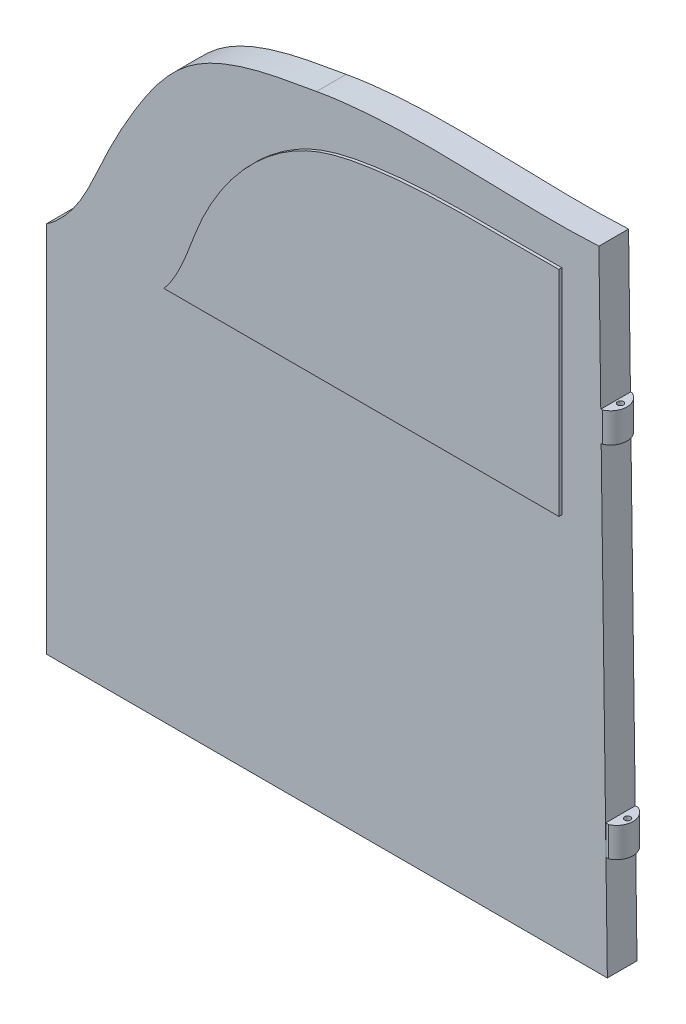
ISO-10303-21;
HEADER;
FILE_DESCRIPTION(('STEP AP214'),'2;1');
FILE_NAME('part.step','',(''),(''),'','','');
FILE_SCHEMA(('AUTOMOTIVE_DESIGN { 1 0 10303 214 1 1 1 1 }'));
ENDSEC;
DATA;
#1=APPLICATION_CONTEXT('core data for automotive mechanical design processes');
#2=APPLICATION_PROTOCOL_DEFINITION('international standard','automotive_design',2000,#1);
#3=PRODUCT_CONTEXT('',#1,'mechanical');
#4=PRODUCT('Part','Part','',(#3));
#5=PRODUCT_RELATED_PRODUCT_CATEGORY('part','',(#4));
#6=PRODUCT_DEFINITION_FORMATION('','',#4);
#7=PRODUCT_DEFINITION_CONTEXT('part definition',#1,'design');
#8=PRODUCT_DEFINITION('design','',#6,#7);
#9=PRODUCT_DEFINITION_SHAPE('','',#8);
#10=(LENGTH_UNIT() NAMED_UNIT(*) SI_UNIT(.MILLI.,.METRE.));
#11=(NAMED_UNIT(*) PLANE_ANGLE_UNIT() SI_UNIT($,.RADIAN.));
#12=(NAMED_UNIT(*) SI_UNIT($,.STERADIAN.) SOLID_ANGLE_UNIT());
#13=UNCERTAINTY_MEASURE_WITH_UNIT(LENGTH_MEASURE(1.E-05),#10,'distance_accuracy_value','');
#14=(GEOMETRIC_REPRESENTATION_CONTEXT(3) GLOBAL_UNCERTAINTY_ASSIGNED_CONTEXT((#13)) GLOBAL_UNIT_ASSIGNED_CONTEXT((#10,
#11,#12)) REPRESENTATION_CONTEXT('',''));
#15=CARTESIAN_POINT('',(0.,0.,0.));
#16=DIRECTION('',(0.,0.,1.));
#17=DIRECTION('',(1.,0.,0.));
#18=AXIS2_PLACEMENT_3D('',#15,#16,#17);
#19=CARTESIAN_POINT('',(138.609555806472,212.457996663782,0.));
#20=DIRECTION('',(0.,0.,1.));
#21=DIRECTION('',(1.,0.,0.));
#22=AXIS2_PLACEMENT_3D('',#19,#20,#21);
#23=PLANE('',#22);
#24=DIRECTION('',(0.,1.,0.));
#25=VECTOR('',#24,1.);
#26=CARTESIAN_POINT('',(173.803726190315,212.457996663782,0.));
#27=LINE('',#26,#25);
#28=CARTESIAN_POINT('',(173.803726190315,127.565231362125,0.));
#29=VERTEX_POINT('',#28);
#30=CARTESIAN_POINT('',(173.803726190315,199.679337800593,0.));
#31=VERTEX_POINT('',#30);
#32=EDGE_CURVE('E489',#29,#31,#27,.T.);
#33=ORIENTED_EDGE('',*,*,#32,.T.);
#34=CARTESIAN_POINT('',(173.803726190315,199.679337800593,0.));
#35=CARTESIAN_POINT('',(152.264868916358,199.362802741396,0.));
#36=CARTESIAN_POINT('',(124.317503439642,201.038762955487,0.));
#37=CARTESIAN_POINT('',(78.4575076434082,191.212262770852,0.));
#38=CARTESIAN_POINT('',(53.3691343930654,161.704453989201,0.));
#39=CARTESIAN_POINT('',(46.7712903409994,134.93330682704,0.));
#40=CARTESIAN_POINT('',(40.691917072669,127.565231362125,0.));
#41=B_SPLINE_CURVE_WITH_KNOTS('',3,(#34,#35,#36,#37,#38,#39,#40),.UNSPECIFIED.,.F.,.F.,(4,1,1,1,
4),(0.,0.388400772627432,0.499498315224305,0.834382390259932,1.),.UNSPECIFIED.);
#42=CARTESIAN_POINT('',(40.691917072669,127.565231362125,0.));
#43=VERTEX_POINT('',#42);
#44=EDGE_CURVE('E63',#31,#43,#41,.T.);
#45=ORIENTED_EDGE('',*,*,#44,.T.);
#46=DIRECTION('',(1.,0.,0.));
#47=VECTOR('',#46,1.);
#48=CARTESIAN_POINT('',(138.609555806472,127.565231362125,0.));
#49=LINE('',#48,#47);
#50=EDGE_CURVE('E485',#43,#29,#49,.T.);
#51=ORIENTED_EDGE('',*,*,#50,.T.);
#52=EDGE_LOOP('',(#33,#45,#51));
#53=FACE_BOUND('',#52,.T.);
#54=DIRECTION('',(-0.0134158665656854,0.999910003212435,0.));
#55=VECTOR('',#54,1.);
#56=CARTESIAN_POINT('',(186.280110434595,212.216863760996,0.));
#57=LINE('',#56,#55);
#58=CARTESIAN_POINT('',(186.972854643501,160.585322797063,0.));
#59=VERTEX_POINT('',#58);
#60=CARTESIAN_POINT('',(186.280110434595,212.216863760996,0.));
#61=VERTEX_POINT('',#60);
#62=EDGE_CURVE('E461',#59,#61,#57,.T.);
#63=ORIENTED_EDGE('',*,*,#62,.F.);
#64=DIRECTION('',(0.,-1.,0.));
#65=VECTOR('',#64,1.);
#66=CARTESIAN_POINT('',(186.972854643501,165.,0.));
#67=LINE('',#66,#65);
#68=CARTESIAN_POINT('',(186.972854643501,165.,0.));
#69=VERTEX_POINT('',#68);
#70=EDGE_CURVE('E276',#69,#59,#67,.T.);
#71=ORIENTED_EDGE('',*,*,#70,.F.);
#72=DIRECTION('',(1.,0.,0.));
#73=VECTOR('',#72,1.);
#74=CARTESIAN_POINT('',(186.972854643501,165.,0.));
#75=LINE('',#74,#73);
#76=CARTESIAN_POINT('',(187.472854643501,165.,0.));
#77=VERTEX_POINT('',#76);
#78=EDGE_CURVE('E272',#69,#77,#75,.T.);
#79=ORIENTED_EDGE('',*,*,#78,.T.);
#80=DIRECTION('',(0.,-1.,0.));
#81=VECTOR('',#80,1.);
#82=CARTESIAN_POINT('',(187.472854643501,165.,0.));
#83=LINE('',#82,#81);
#84=CARTESIAN_POINT('',(187.472854643501,155.,0.));
#85=VERTEX_POINT('',#84);
#86=EDGE_CURVE('E280',#77,#85,#83,.T.);
#87=ORIENTED_EDGE('',*,*,#86,.T.);
#88=DIRECTION('',(1.,0.,0.));
#89=VECTOR('',#88,1.);
#90=CARTESIAN_POINT('',(186.972854643501,155.,0.));
#91=LINE('',#90,#89);
#92=CARTESIAN_POINT('',(187.047793333114,155.,0.));
#93=VERTEX_POINT('',#92);
#94=EDGE_CURVE('E259',#93,#85,#91,.T.);
#95=ORIENTED_EDGE('',*,*,#94,.F.);
#96=CARTESIAN_POINT('',(188.575018149559,41.1730352161484,0.));
#97=VERTEX_POINT('',#96);
#98=EDGE_CURVE('E465',#97,#93,#57,.T.);
#99=ORIENTED_EDGE('',*,*,#98,.F.);
#100=DIRECTION('',(0.,-1.,0.));
#101=VECTOR('',#100,1.);
#102=CARTESIAN_POINT('',(188.575018149559,45.,0.));
#103=LINE('',#102,#101);
#104=CARTESIAN_POINT('',(188.575018149559,45.,0.));
#105=VERTEX_POINT('',#104);
#106=EDGE_CURVE('E324',#105,#97,#103,.T.);
#107=ORIENTED_EDGE('',*,*,#106,.F.);
#108=DIRECTION('',(1.,0.,0.));
#109=VECTOR('',#108,1.);
#110=CARTESIAN_POINT('',(188.575018149559,45.,0.));
#111=LINE('',#110,#109);
#112=CARTESIAN_POINT('',(189.575018149559,45.,0.));
#113=VERTEX_POINT('',#112);
#114=EDGE_CURVE('E320',#105,#113,#111,.T.);
#115=ORIENTED_EDGE('',*,*,#114,.T.);
#116=DIRECTION('',(0.,-1.,0.));
#117=VECTOR('',#116,1.);
#118=CARTESIAN_POINT('',(189.575018149559,45.,0.));
#119=LINE('',#118,#117);
#120=CARTESIAN_POINT('',(189.575018149559,35.,0.));
#121=VERTEX_POINT('',#120);
#122=EDGE_CURVE('E328',#113,#121,#119,.T.);
#123=ORIENTED_EDGE('',*,*,#122,.T.);
#124=DIRECTION('',(1.,0.,0.));
#125=VECTOR('',#124,1.);
#126=CARTESIAN_POINT('',(188.575018149559,35.,0.));
#127=LINE('',#126,#125);
#128=CARTESIAN_POINT('',(188.657842220224,35.,0.));
#129=VERTEX_POINT('',#128);
#130=EDGE_CURVE('E307',#129,#121,#127,.T.);
#131=ORIENTED_EDGE('',*,*,#130,.F.);
#132=CARTESIAN_POINT('',(189.127439812298,0.,0.));
#133=VERTEX_POINT('',#132);
#134=EDGE_CURVE('E462',#133,#129,#57,.T.);
#135=ORIENTED_EDGE('',*,*,#134,.F.);
#136=DIRECTION('',(1.,0.,0.));
#137=VECTOR('',#136,1.);
#138=CARTESIAN_POINT('',(189.127439812298,0.,0.));
#139=LINE('',#138,#137);
#140=CARTESIAN_POINT('',(0.,0.,0.));
#141=VERTEX_POINT('',#140);
#142=EDGE_CURVE('E458',#141,#133,#139,.T.);
#143=ORIENTED_EDGE('',*,*,#142,.F.);
#144=DIRECTION('',(0.,-1.,0.));
#145=VECTOR('',#144,1.);
#146=CARTESIAN_POINT('',(0.,0.,0.));
#147=LINE('',#146,#145);
#148=CARTESIAN_POINT('',(0.,125.576698410894,0.));
#149=VERTEX_POINT('',#148);
#150=EDGE_CURVE('E452',#149,#141,#147,.T.);
#151=ORIENTED_EDGE('',*,*,#150,.F.);
#152=CARTESIAN_POINT('',(91.0979569513852,209.776295722965,0.));
#153=CARTESIAN_POINT('',(76.8678960286679,207.296992896224,0.));
#154=CARTESIAN_POINT('',(49.352217031208,203.040751330026,0.));
#155=CARTESIAN_POINT('',(30.538510920932,175.763388939779,0.));
#156=CARTESIAN_POINT('',(17.0981654853638,150.751131910875,0.));
#157=CARTESIAN_POINT('',(10.5570019054249,132.837635912411,0.));
#158=CARTESIAN_POINT('',(0.,125.576698410894,0.));
#159=B_SPLINE_CURVE_WITH_KNOTS('',3,(#152,#153,#154,#155,#156,#157,#158),.UNSPECIFIED.,.F.,.F.,
(4,1,1,1,4),(0.,0.344171163029158,0.573428409171298,0.724753948628638,1.),.UNSPECIFIED.);
#160=CARTESIAN_POINT('',(91.0979569513852,209.776295722965,0.));
#161=VERTEX_POINT('',#160);
#162=EDGE_CURVE('E443',#161,#149,#159,.T.);
#163=ORIENTED_EDGE('',*,*,#162,.F.);
#164=CARTESIAN_POINT('',(186.280110434595,212.216863760996,0.));
#165=CARTESIAN_POINT('',(154.601009659826,210.515513686985,0.));
#166=CARTESIAN_POINT('',(122.56511669544,215.374757588446,0.));
#167=CARTESIAN_POINT('',(91.0979569513852,209.776295722965,0.));
#168=B_SPLINE_CURVE_WITH_KNOTS('',3,(#164,#165,#166,#167),.UNSPECIFIED.,.F.,.F.,(4,4),(0.,1.),.UNSPECIFIED.);
#169=EDGE_CURVE('E437',#61,#161,#168,.T.);
#170=ORIENTED_EDGE('',*,*,#169,.F.);
#171=EDGE_LOOP('',(#63,#71,#79,#87,#95,#99,#107,#115,#123,#131,#135,#143,#151,#163,#170));
#172=FACE_BOUND('',#171,.T.);
#173=CARTESIAN_POINT('',(30.,100.,0.));
#174=DIRECTION('',(0.,0.,1.));
#175=DIRECTION('',(0.,1.,0.));
#176=AXIS2_PLACEMENT_3D('',#173,#174,#175);
#177=CIRCLE('',#176,12.0323126663804);
#178=CARTESIAN_POINT('',(42.0323126663804,100.,0.));
#179=VERTEX_POINT('',#178);
#180=CARTESIAN_POINT('',(17.9676873336196,100.,0.));
#181=VERTEX_POINT('',#180);
#182=EDGE_CURVE('E228',#179,#181,#177,.T.);
#183=ORIENTED_EDGE('',*,*,#182,.T.);
#184=DIRECTION('',(1.,0.,0.));
#185=VECTOR('',#184,1.);
#186=CARTESIAN_POINT('',(17.9676873336196,100.,0.));
#187=LINE('',#186,#185);
#188=CARTESIAN_POINT('',(20.0034797066069,100.,0.));
#189=VERTEX_POINT('',#188);
#190=EDGE_CURVE('E225',#181,#189,#187,.T.);
#191=ORIENTED_EDGE('',*,*,#190,.T.);
#192=DIRECTION('',(-1.,0.,0.));
#193=VECTOR('',#192,1.);
#194=CARTESIAN_POINT('',(20.0034797066069,100.,0.));
#195=LINE('',#194,#193);
#196=CARTESIAN_POINT('',(39.8045608326128,100.,0.));
#197=VERTEX_POINT('',#196);
#198=EDGE_CURVE('E214',#197,#189,#195,.T.);
#199=ORIENTED_EDGE('',*,*,#198,.F.);
#200=EDGE_CURVE('E77',#197,#179,#187,.T.);
#201=ORIENTED_EDGE('',*,*,#200,.T.);
#202=EDGE_LOOP('',(#183,#191,#199,#201));
#203=FACE_BOUND('',#202,.T.);
#204=ADVANCED_FACE('F53',(#53,#172,#203),#23,.F.);
#205=CARTESIAN_POINT('',(186.280110434595,212.216863760996,10.));
#206=DIRECTION('',(-0.999910003212435,-0.0134158665656854,0.));
#207=DIRECTION('',(0.0134158665656854,-0.999910003212435,0.));
#208=AXIS2_PLACEMENT_3D('',#205,#206,#207);
#209=PLANE('',#208);
#210=DIRECTION('',(0.,0.,1.));
#211=VECTOR('',#210,1.);
#212=CARTESIAN_POINT('',(186.972854643501,160.585322797063,10.));
#213=LINE('',#212,#211);
#214=CARTESIAN_POINT('',(186.972854643501,160.585322797063,10.));
#215=VERTEX_POINT('',#214);
#216=EDGE_CURVE('E296',#59,#215,#213,.T.);
#217=ORIENTED_EDGE('',*,*,#216,.F.);
#218=ORIENTED_EDGE('',*,*,#62,.T.);
#219=DIRECTION('',(0.,0.,-1.));
#220=VECTOR('',#219,1.);
#221=CARTESIAN_POINT('',(186.280110434595,212.216863760996,10.));
#222=LINE('',#221,#220);
#223=CARTESIAN_POINT('',(186.280110434595,212.216863760996,10.));
#224=VERTEX_POINT('',#223);
#225=EDGE_CURVE('E436',#224,#61,#222,.T.);
#226=ORIENTED_EDGE('',*,*,#225,.F.);
#227=DIRECTION('',(-0.0134158665656854,0.999910003212435,0.));
#228=VECTOR('',#227,1.);
#229=CARTESIAN_POINT('',(186.280110434595,212.216863760996,10.));
#230=LINE('',#229,#228);
#231=EDGE_CURVE('E431',#215,#224,#230,.T.);
#232=ORIENTED_EDGE('',*,*,#231,.F.);
#233=EDGE_LOOP('',(#217,#218,#226,#232));
#234=FACE_BOUND('',#233,.T.);
#235=ADVANCED_FACE('F395',(#234),#209,.F.);
#236=DIRECTION('',(0.,0.,-1.));
#237=VECTOR('',#236,1.);
#238=CARTESIAN_POINT('',(187.047793333114,155.,10.));
#239=LINE('',#238,#237);
#240=CARTESIAN_POINT('',(187.047793333114,155.,10.));
#241=VERTEX_POINT('',#240);
#242=EDGE_CURVE('E292',#241,#93,#239,.T.);
#243=ORIENTED_EDGE('',*,*,#242,.F.);
#244=CARTESIAN_POINT('',(189.127439812298,0.,10.));
#245=VERTEX_POINT('',#244);
#246=EDGE_CURVE('E432',#245,#241,#230,.T.);
#247=ORIENTED_EDGE('',*,*,#246,.F.);
#248=DIRECTION('',(0.,0.,-1.));
#249=VECTOR('',#248,1.);
#250=CARTESIAN_POINT('',(189.127439812298,0.,10.));
#251=LINE('',#250,#249);
#252=EDGE_CURVE('E469',#245,#133,#251,.T.);
#253=ORIENTED_EDGE('',*,*,#252,.T.);
#254=ORIENTED_EDGE('',*,*,#134,.T.);
#255=DIRECTION('',(0.,0.,-1.));
#256=VECTOR('',#255,1.);
#257=CARTESIAN_POINT('',(188.657842220224,35.,10.));
#258=LINE('',#257,#256);
#259=CARTESIAN_POINT('',(188.657842220224,35.,9.98072031952588));
#260=VERTEX_POINT('',#259);
#261=EDGE_CURVE('E340',#260,#129,#258,.T.);
#262=ORIENTED_EDGE('',*,*,#261,.F.);
#263=DIRECTION('',(0.0134158665656854,-0.999910003212435,0.));
#264=VECTOR('',#263,1.);
#265=CARTESIAN_POINT('',(186.280110434595,212.216863760996,9.98072031952588));
#266=LINE('',#265,#264);
#267=CARTESIAN_POINT('',(188.575018149559,41.1730352161485,9.98072031952588));
#268=VERTEX_POINT('',#267);
#269=EDGE_CURVE('E11',#268,#260,#266,.T.);
#270=ORIENTED_EDGE('',*,*,#269,.F.);
#271=DIRECTION('',(0.,0.,1.));
#272=VECTOR('',#271,1.);
#273=CARTESIAN_POINT('',(188.575018149559,41.1730352161484,10.));
#274=LINE('',#273,#272);
#275=EDGE_CURVE('E344',#97,#268,#274,.T.);
#276=ORIENTED_EDGE('',*,*,#275,.F.);
#277=ORIENTED_EDGE('',*,*,#98,.T.);
#278=EDGE_LOOP('',(#243,#247,#253,#254,#262,#270,#276,#277));
#279=FACE_BOUND('',#278,.T.);
#280=ADVANCED_FACE('F399',(#279),#209,.F.);
#281=CARTESIAN_POINT('',(186.280110434595,212.216863760996,10.));
#282=CARTESIAN_POINT('',(154.601009659826,210.515513686985,10.));
#283=CARTESIAN_POINT('',(122.56511669544,215.374757588446,10.));
#284=CARTESIAN_POINT('',(91.0979569513852,209.776295722965,10.));
#285=B_SPLINE_CURVE_WITH_KNOTS('',3,(#281,#282,#283,#284),.UNSPECIFIED.,.F.,.F.,(4,4),(0.,1.),.UNSPECIFIED.);
#286=DIRECTION('',(0.,0.,-1.));
#287=VECTOR('',#286,1.);
#288=SURFACE_OF_LINEAR_EXTRUSION('',#285,#287);
#289=ORIENTED_EDGE('',*,*,#169,.T.);
#290=DIRECTION('',(0.,0.,-1.));
#291=VECTOR('',#290,1.);
#292=CARTESIAN_POINT('',(91.0979569513852,209.776295722965,10.));
#293=LINE('',#292,#291);
#294=CARTESIAN_POINT('',(91.0979569513852,209.776295722965,10.));
#295=VERTEX_POINT('',#294);
#296=EDGE_CURVE('E481',#295,#161,#293,.T.);
#297=ORIENTED_EDGE('',*,*,#296,.F.);
#298=EDGE_CURVE('E418',#224,#295,#285,.T.);
#299=ORIENTED_EDGE('',*,*,#298,.F.);
#300=ORIENTED_EDGE('',*,*,#225,.T.);
#301=EDGE_LOOP('',(#289,#297,#299,#300));
#302=FACE_BOUND('',#301,.T.);
#303=ADVANCED_FACE('F55',(#302),#288,.F.);
#304=CARTESIAN_POINT('',(91.0979569513852,209.776295722965,10.));
#305=CARTESIAN_POINT('',(76.8678960286679,207.296992896224,10.));
#306=CARTESIAN_POINT('',(49.352217031208,203.040751330026,10.));
#307=CARTESIAN_POINT('',(30.538510920932,175.763388939779,10.));
#308=CARTESIAN_POINT('',(17.0981654853638,150.751131910875,10.));
#309=CARTESIAN_POINT('',(10.5570019054249,132.837635912411,10.));
#310=CARTESIAN_POINT('',(0.,125.576698410894,10.));
#311=B_SPLINE_CURVE_WITH_KNOTS('',3,(#304,#305,#306,#307,#308,#309,#310),.UNSPECIFIED.,.F.,.F.,
(4,1,1,1,4),(0.,0.344171163029158,0.573428409171298,0.724753948628638,1.),.UNSPECIFIED.);
#312=DIRECTION('',(0.,0.,-1.));
#313=VECTOR('',#312,1.);
#314=SURFACE_OF_LINEAR_EXTRUSION('',#311,#313);
#315=ORIENTED_EDGE('',*,*,#162,.T.);
#316=DIRECTION('',(0.,0.,-1.));
#317=VECTOR('',#316,1.);
#318=CARTESIAN_POINT('',(0.,125.576698410894,10.));
#319=LINE('',#318,#317);
#320=CARTESIAN_POINT('',(0.,125.576698410894,10.));
#321=VERTEX_POINT('',#320);
#322=EDGE_CURVE('E477',#321,#149,#319,.T.);
#323=ORIENTED_EDGE('',*,*,#322,.F.);
#324=EDGE_CURVE('E411',#295,#321,#311,.T.);
#325=ORIENTED_EDGE('',*,*,#324,.F.);
#326=ORIENTED_EDGE('',*,*,#296,.T.);
#327=EDGE_LOOP('',(#315,#323,#325,#326));
#328=FACE_BOUND('',#327,.T.);
#329=ADVANCED_FACE('F406',(#328),#314,.F.);
#330=CARTESIAN_POINT('',(0.,0.,10.));
#331=DIRECTION('',(1.,0.,0.));
#332=DIRECTION('',(0.,0.,-1.));
#333=AXIS2_PLACEMENT_3D('',#330,#331,#332);
#334=PLANE('',#333);
#335=ORIENTED_EDGE('',*,*,#150,.T.);
#336=DIRECTION('',(0.,0.,-1.));
#337=VECTOR('',#336,1.);
#338=CARTESIAN_POINT('',(0.,0.,10.));
#339=LINE('',#338,#337);
#340=CARTESIAN_POINT('',(0.,0.,10.));
#341=VERTEX_POINT('',#340);
#342=EDGE_CURVE('E473',#341,#141,#339,.T.);
#343=ORIENTED_EDGE('',*,*,#342,.F.);
#344=DIRECTION('',(0.,-1.,0.));
#345=VECTOR('',#344,1.);
#346=CARTESIAN_POINT('',(0.,0.,10.));
#347=LINE('',#346,#345);
#348=EDGE_CURVE('E417',#321,#341,#347,.T.);
#349=ORIENTED_EDGE('',*,*,#348,.F.);
#350=ORIENTED_EDGE('',*,*,#322,.T.);
#351=EDGE_LOOP('',(#335,#343,#349,#350));
#352=FACE_BOUND('',#351,.T.);
#353=ADVANCED_FACE('F403',(#352),#334,.F.);
#354=CARTESIAN_POINT('',(189.127439812298,0.,10.));
#355=DIRECTION('',(0.,1.,0.));
#356=DIRECTION('',(0.,0.,1.));
#357=AXIS2_PLACEMENT_3D('',#354,#355,#356);
#358=PLANE('',#357);
#359=ORIENTED_EDGE('',*,*,#142,.T.);
#360=ORIENTED_EDGE('',*,*,#252,.F.);
#361=DIRECTION('',(1.,0.,0.));
#362=VECTOR('',#361,1.);
#363=CARTESIAN_POINT('',(189.127439812298,0.,10.));
#364=LINE('',#363,#362);
#365=EDGE_CURVE('E428',#341,#245,#364,.T.);
#366=ORIENTED_EDGE('',*,*,#365,.F.);
#367=ORIENTED_EDGE('',*,*,#342,.T.);
#368=EDGE_LOOP('',(#359,#360,#366,#367));
#369=FACE_BOUND('',#368,.T.);
#370=ADVANCED_FACE('F391',(#369),#358,.F.);
#371=CARTESIAN_POINT('',(138.609555806472,212.457996663782,10.));
#372=DIRECTION('',(0.,0.,1.));
#373=DIRECTION('',(1.,0.,0.));
#374=AXIS2_PLACEMENT_3D('',#371,#372,#373);
#375=PLANE('',#374);
#376=ORIENTED_EDGE('',*,*,#246,.T.);
#377=DIRECTION('',(1.,0.,0.));
#378=VECTOR('',#377,1.);
#379=CARTESIAN_POINT('',(186.972854643501,155.,10.));
#380=LINE('',#379,#378);
#381=CARTESIAN_POINT('',(187.472854643501,155.,10.));
#382=VERTEX_POINT('',#381);
#383=EDGE_CURVE('E249',#241,#382,#380,.T.);
#384=ORIENTED_EDGE('',*,*,#383,.T.);
#385=DIRECTION('',(0.,-1.,0.));
#386=VECTOR('',#385,1.);
#387=CARTESIAN_POINT('',(187.472854643501,165.,10.));
#388=LINE('',#387,#386);
#389=CARTESIAN_POINT('',(187.472854643501,165.,10.));
#390=VERTEX_POINT('',#389);
#391=EDGE_CURVE('E284',#390,#382,#388,.T.);
#392=ORIENTED_EDGE('',*,*,#391,.F.);
#393=DIRECTION('',(1.,0.,0.));
#394=VECTOR('',#393,1.);
#395=CARTESIAN_POINT('',(186.972854643501,165.,10.));
#396=LINE('',#395,#394);
#397=CARTESIAN_POINT('',(186.972854643501,165.,10.));
#398=VERTEX_POINT('',#397);
#399=EDGE_CURVE('E266',#398,#390,#396,.T.);
#400=ORIENTED_EDGE('',*,*,#399,.F.);
#401=DIRECTION('',(0.,-1.,0.));
#402=VECTOR('',#401,1.);
#403=CARTESIAN_POINT('',(186.972854643501,165.,10.));
#404=LINE('',#403,#402);
#405=EDGE_CURVE('E288',#398,#215,#404,.T.);
#406=ORIENTED_EDGE('',*,*,#405,.T.);
#407=ORIENTED_EDGE('',*,*,#231,.T.);
#408=ORIENTED_EDGE('',*,*,#298,.T.);
#409=ORIENTED_EDGE('',*,*,#324,.T.);
#410=ORIENTED_EDGE('',*,*,#348,.T.);
#411=ORIENTED_EDGE('',*,*,#365,.T.);
#412=EDGE_LOOP('',(#376,#384,#392,#400,#406,#407,#408,#409,#410,#411));
#413=FACE_BOUND('',#412,.T.);
#414=CARTESIAN_POINT('',(173.803726190315,199.679337800593,10.));
#415=CARTESIAN_POINT('',(152.264868916358,199.362802741396,10.));
#416=CARTESIAN_POINT('',(124.317503439642,201.038762955487,10.));
#417=CARTESIAN_POINT('',(78.4575076434082,191.212262770852,10.));
#418=CARTESIAN_POINT('',(53.3691343930654,161.704453989201,10.));
#419=CARTESIAN_POINT('',(46.7712903409994,134.93330682704,10.));
#420=CARTESIAN_POINT('',(40.691917072669,127.565231362125,10.));
#421=B_SPLINE_CURVE_WITH_KNOTS('',3,(#414,#415,#416,#417,#418,#419,#420),.UNSPECIFIED.,.F.,.F.,
(4,1,1,1,4),(0.,0.388400772627432,0.499498315224305,0.834382390259932,1.),.UNSPECIFIED.);
#422=CARTESIAN_POINT('',(173.803726190315,199.679337800593,10.));
#423=VERTEX_POINT('',#422);
#424=CARTESIAN_POINT('',(40.691917072669,127.565231362125,10.));
#425=VERTEX_POINT('',#424);
#426=EDGE_CURVE('E444',#423,#425,#421,.T.);
#427=ORIENTED_EDGE('',*,*,#426,.F.);
#428=DIRECTION('',(0.,1.,0.));
#429=VECTOR('',#428,1.);
#430=CARTESIAN_POINT('',(173.803726190315,212.457996663782,10.));
#431=LINE('',#430,#429);
#432=CARTESIAN_POINT('',(173.803726190315,127.565231362125,10.));
#433=VERTEX_POINT('',#432);
#434=EDGE_CURVE('E521',#433,#423,#431,.T.);
#435=ORIENTED_EDGE('',*,*,#434,.F.);
#436=DIRECTION('',(1.,0.,0.));
#437=VECTOR('',#436,1.);
#438=CARTESIAN_POINT('',(138.609555806472,127.565231362125,10.));
#439=LINE('',#438,#437);
#440=EDGE_CURVE('E514',#425,#433,#439,.T.);
#441=ORIENTED_EDGE('',*,*,#440,.F.);
#442=EDGE_LOOP('',(#427,#435,#441));
#443=FACE_BOUND('',#442,.T.);
#444=ADVANCED_FACE('F387',(#413,#443),#375,.T.);
#445=CARTESIAN_POINT('',(91.065816685106,192.807013880418,-1.));
#446=DIRECTION('',(0.,0.,-1.));
#447=DIRECTION('',(-1.,0.,0.));
#448=AXIS2_PLACEMENT_3D('',#445,#446,#447);
#449=PLANE('',#448);
#450=CARTESIAN_POINT('',(173.803726190315,199.679337800593,-1.));
#451=CARTESIAN_POINT('',(152.264868916358,199.362802741396,-1.));
#452=CARTESIAN_POINT('',(124.317503439642,201.038762955487,-1.));
#453=CARTESIAN_POINT('',(78.4575076434082,191.212262770852,-1.));
#454=CARTESIAN_POINT('',(53.3691343930654,161.704453989201,-1.));
#455=CARTESIAN_POINT('',(46.7712903409994,134.93330682704,-1.));
#456=CARTESIAN_POINT('',(40.691917072669,127.565231362125,-1.));
#457=B_SPLINE_CURVE_WITH_KNOTS('',3,(#450,#451,#452,#453,#454,#455,#456),.UNSPECIFIED.,.F.,.F.,
(4,1,1,1,4),(0.,0.388400772627432,0.499498315224305,0.834382390259932,1.),.UNSPECIFIED.);
#458=CARTESIAN_POINT('',(173.803726190315,199.679337800593,-1.));
#459=VERTEX_POINT('',#458);
#460=CARTESIAN_POINT('',(40.691917072669,127.565231362125,-1.));
#461=VERTEX_POINT('',#460);
#462=EDGE_CURVE('E365',#459,#461,#457,.T.);
#463=ORIENTED_EDGE('',*,*,#462,.F.);
#464=DIRECTION('',(0.,1.,0.));
#465=VECTOR('',#464,1.);
#466=CARTESIAN_POINT('',(173.803726190315,127.565231362125,-1.));
#467=LINE('',#466,#465);
#468=CARTESIAN_POINT('',(173.803726190315,127.565231362125,-1.));
#469=VERTEX_POINT('',#468);
#470=EDGE_CURVE('E512',#469,#459,#467,.T.);
#471=ORIENTED_EDGE('',*,*,#470,.F.);
#472=DIRECTION('',(1.,0.,0.));
#473=VECTOR('',#472,1.);
#474=CARTESIAN_POINT('',(40.691917072669,127.565231362125,-1.));
#475=LINE('',#474,#473);
#476=EDGE_CURVE('E372',#461,#469,#475,.T.);
#477=ORIENTED_EDGE('',*,*,#476,.F.);
#478=EDGE_LOOP('',(#463,#471,#477));
#479=FACE_BOUND('',#478,.T.);
#480=ADVANCED_FACE('F390',(#479),#449,.T.);
#481=CARTESIAN_POINT('',(40.691917072669,127.565231362125,-1.));
#482=DIRECTION('',(0.,-1.,0.));
#483=DIRECTION('',(0.,0.,-1.));
#484=AXIS2_PLACEMENT_3D('',#481,#482,#483);
#485=PLANE('',#484);
#486=ORIENTED_EDGE('',*,*,#50,.F.);
#487=DIRECTION('',(0.,0.,1.));
#488=VECTOR('',#487,1.);
#489=CARTESIAN_POINT('',(40.691917072669,127.565231362125,-1.));
#490=LINE('',#489,#488);
#491=EDGE_CURVE('E507',#461,#43,#490,.T.);
#492=ORIENTED_EDGE('',*,*,#491,.F.);
#493=ORIENTED_EDGE('',*,*,#476,.T.);
#494=DIRECTION('',(0.,0.,1.));
#495=VECTOR('',#494,1.);
#496=CARTESIAN_POINT('',(173.803726190315,127.565231362125,-1.));
#497=LINE('',#496,#495);
#498=EDGE_CURVE('E523',#469,#29,#497,.T.);
#499=ORIENTED_EDGE('',*,*,#498,.T.);
#500=EDGE_LOOP('',(#486,#492,#493,#499));
#501=FACE_BOUND('',#500,.T.);
#502=ADVANCED_FACE('F557',(#501),#485,.T.);
#503=CARTESIAN_POINT('',(173.803726190315,127.565231362125,-1.));
#504=DIRECTION('',(1.,0.,0.));
#505=DIRECTION('',(0.,0.,-1.));
#506=AXIS2_PLACEMENT_3D('',#503,#504,#505);
#507=PLANE('',#506);
#508=ORIENTED_EDGE('',*,*,#32,.F.);
#509=ORIENTED_EDGE('',*,*,#498,.F.);
#510=ORIENTED_EDGE('',*,*,#470,.T.);
#511=DIRECTION('',(0.,0.,1.));
#512=VECTOR('',#511,1.);
#513=CARTESIAN_POINT('',(173.803726190315,199.679337800593,-1.));
#514=LINE('',#513,#512);
#515=EDGE_CURVE('E505',#459,#31,#514,.T.);
#516=ORIENTED_EDGE('',*,*,#515,.T.);
#517=EDGE_LOOP('',(#508,#509,#510,#516));
#518=FACE_BOUND('',#517,.T.);
#519=ADVANCED_FACE('F510',(#518),#507,.T.);
#520=DIRECTION('',(0.,0.,1.));
#521=VECTOR('',#520,1.);
#522=SURFACE_OF_LINEAR_EXTRUSION('',#457,#521);
#523=ORIENTED_EDGE('',*,*,#44,.F.);
#524=ORIENTED_EDGE('',*,*,#515,.F.);
#525=ORIENTED_EDGE('',*,*,#462,.T.);
#526=ORIENTED_EDGE('',*,*,#491,.T.);
#527=EDGE_LOOP('',(#523,#524,#525,#526));
#528=FACE_BOUND('',#527,.T.);
#529=ADVANCED_FACE('F383',(#528),#522,.T.);
#530=CARTESIAN_POINT('',(173.803726190315,199.679337800593,11.));
#531=VERTEX_POINT('',#530);
#532=EDGE_CURVE('E515',#423,#531,#514,.T.);
#533=ORIENTED_EDGE('',*,*,#532,.F.);
#534=ORIENTED_EDGE('',*,*,#426,.T.);
#535=CARTESIAN_POINT('',(40.691917072669,127.565231362125,11.));
#536=VERTEX_POINT('',#535);
#537=EDGE_CURVE('E529',#425,#536,#490,.T.);
#538=ORIENTED_EDGE('',*,*,#537,.T.);
#539=CARTESIAN_POINT('',(173.803726190315,199.679337800593,11.));
#540=CARTESIAN_POINT('',(152.264868916358,199.362802741396,11.));
#541=CARTESIAN_POINT('',(124.317503439642,201.038762955487,11.));
#542=CARTESIAN_POINT('',(78.4575076434082,191.212262770852,11.));
#543=CARTESIAN_POINT('',(53.3691343930654,161.704453989201,11.));
#544=CARTESIAN_POINT('',(46.7712903409994,134.93330682704,11.));
#545=CARTESIAN_POINT('',(40.691917072669,127.565231362125,11.));
#546=B_SPLINE_CURVE_WITH_KNOTS('',3,(#539,#540,#541,#542,#543,#544,#545),.UNSPECIFIED.,.F.,.F.,
(4,1,1,1,4),(0.,0.388400772627432,0.499498315224305,0.834382390259932,1.),.UNSPECIFIED.);
#547=EDGE_CURVE('E348',#531,#536,#546,.T.);
#548=ORIENTED_EDGE('',*,*,#547,.F.);
#549=EDGE_LOOP('',(#533,#534,#538,#548));
#550=FACE_BOUND('',#549,.T.);
#551=ADVANCED_FACE('F378',(#550),#522,.T.);
#552=CARTESIAN_POINT('',(173.803726190315,127.565231362125,11.));
#553=VERTEX_POINT('',#552);
#554=EDGE_CURVE('E527',#433,#553,#497,.T.);
#555=ORIENTED_EDGE('',*,*,#554,.F.);
#556=ORIENTED_EDGE('',*,*,#434,.T.);
#557=ORIENTED_EDGE('',*,*,#532,.T.);
#558=DIRECTION('',(0.,1.,0.));
#559=VECTOR('',#558,1.);
#560=CARTESIAN_POINT('',(173.803726190315,127.565231362125,11.));
#561=LINE('',#560,#559);
#562=EDGE_CURVE('E361',#553,#531,#561,.T.);
#563=ORIENTED_EDGE('',*,*,#562,.F.);
#564=EDGE_LOOP('',(#555,#556,#557,#563));
#565=FACE_BOUND('',#564,.T.);
#566=ADVANCED_FACE('F382',(#565),#507,.T.);
#567=ORIENTED_EDGE('',*,*,#537,.F.);
#568=ORIENTED_EDGE('',*,*,#440,.T.);
#569=ORIENTED_EDGE('',*,*,#554,.T.);
#570=DIRECTION('',(1.,0.,0.));
#571=VECTOR('',#570,1.);
#572=CARTESIAN_POINT('',(40.691917072669,127.565231362125,11.));
#573=LINE('',#572,#571);
#574=EDGE_CURVE('E354',#536,#553,#573,.T.);
#575=ORIENTED_EDGE('',*,*,#574,.F.);
#576=EDGE_LOOP('',(#567,#568,#569,#575));
#577=FACE_BOUND('',#576,.T.);
#578=ADVANCED_FACE('F385',(#577),#485,.T.);
#579=CARTESIAN_POINT('',(91.065816685106,192.807013880418,11.));
#580=DIRECTION('',(0.,0.,-1.));
#581=DIRECTION('',(-1.,0.,0.));
#582=AXIS2_PLACEMENT_3D('',#579,#580,#581);
#583=PLANE('',#582);
#584=ORIENTED_EDGE('',*,*,#547,.T.);
#585=ORIENTED_EDGE('',*,*,#574,.T.);
#586=ORIENTED_EDGE('',*,*,#562,.T.);
#587=EDGE_LOOP('',(#584,#585,#586));
#588=FACE_BOUND('',#587,.T.);
#589=ADVANCED_FACE('F565',(#588),#583,.F.);
#590=CARTESIAN_POINT('',(188.575018149559,45.,9.98072031952588));
#591=DIRECTION('',(0.,0.,-1.));
#592=DIRECTION('',(-1.,0.,0.));
#593=AXIS2_PLACEMENT_3D('',#590,#591,#592);
#594=PLANE('',#593);
#595=DIRECTION('',(0.,-1.,0.));
#596=VECTOR('',#595,1.);
#597=CARTESIAN_POINT('',(188.575018149559,45.,9.98072031952588));
#598=LINE('',#597,#596);
#599=CARTESIAN_POINT('',(188.575018149559,45.,9.98072031952588));
#600=VERTEX_POINT('',#599);
#601=EDGE_CURVE('E336',#600,#268,#598,.T.);
#602=ORIENTED_EDGE('',*,*,#601,.T.);
#603=ORIENTED_EDGE('',*,*,#269,.T.);
#604=DIRECTION('',(1.,0.,0.));
#605=VECTOR('',#604,1.);
#606=CARTESIAN_POINT('',(188.575018149559,35.,9.98072031952588));
#607=LINE('',#606,#605);
#608=CARTESIAN_POINT('',(189.575018149559,35.,9.98072031952588));
#609=VERTEX_POINT('',#608);
#610=EDGE_CURVE('E300',#260,#609,#607,.T.);
#611=ORIENTED_EDGE('',*,*,#610,.T.);
#612=DIRECTION('',(0.,-1.,0.));
#613=VECTOR('',#612,1.);
#614=CARTESIAN_POINT('',(189.575018149559,45.,9.98072031952588));
#615=LINE('',#614,#613);
#616=CARTESIAN_POINT('',(189.575018149559,45.,9.98072031952588));
#617=VERTEX_POINT('',#616);
#618=EDGE_CURVE('E332',#617,#609,#615,.T.);
#619=ORIENTED_EDGE('',*,*,#618,.F.);
#620=DIRECTION('',(1.,0.,0.));
#621=VECTOR('',#620,1.);
#622=CARTESIAN_POINT('',(188.575018149559,45.,9.98072031952588));
#623=LINE('',#622,#621);
#624=EDGE_CURVE('E314',#600,#617,#623,.T.);
#625=ORIENTED_EDGE('',*,*,#624,.F.);
#626=EDGE_LOOP('',(#602,#603,#611,#619,#625));
#627=FACE_BOUND('',#626,.T.);
#628=ADVANCED_FACE('F600',(#627),#594,.F.);
#629=CARTESIAN_POINT('',(188.575018149559,45.,0.));
#630=DIRECTION('',(1.,0.,0.));
#631=DIRECTION('',(0.,0.,-1.));
#632=AXIS2_PLACEMENT_3D('',#629,#630,#631);
#633=PLANE('',#632);
#634=ORIENTED_EDGE('',*,*,#106,.T.);
#635=ORIENTED_EDGE('',*,*,#275,.T.);
#636=ORIENTED_EDGE('',*,*,#601,.F.);
#637=DIRECTION('',(0.,0.,1.));
#638=VECTOR('',#637,1.);
#639=CARTESIAN_POINT('',(188.575018149559,45.,0.));
#640=LINE('',#639,#638);
#641=EDGE_CURVE('E310',#105,#600,#640,.T.);
#642=ORIENTED_EDGE('',*,*,#641,.F.);
#643=EDGE_LOOP('',(#634,#635,#636,#642));
#644=FACE_BOUND('',#643,.T.);
#645=ADVANCED_FACE('F612',(#644),#633,.F.);
#646=CARTESIAN_POINT('',(187.26281022728,35.,4.99036015976294));
#647=DIRECTION('',(0.,1.,0.));
#648=DIRECTION('',(0.,0.,1.));
#649=AXIS2_PLACEMENT_3D('',#646,#647,#648);
#650=PLANE('',#649);
#651=CARTESIAN_POINT('',(190.945125019789,35.,4.99518007988147));
#652=DIRECTION('',(0.,-1.,0.));
#653=DIRECTION('',(0.,0.,-1.));
#654=AXIS2_PLACEMENT_3D('',#651,#652,#653);
#655=CIRCLE('',#654,0.999999999999998);
#656=CARTESIAN_POINT('',(190.945125019789,35.,3.99518007988147));
#657=VERTEX_POINT('',#656);
#658=EDGE_CURVE('E230',#657,#657,#655,.T.);
#659=ORIENTED_EDGE('',*,*,#658,.F.);
#660=EDGE_LOOP('',(#659));
#661=FACE_BOUND('',#660,.T.);
#662=ORIENTED_EDGE('',*,*,#610,.F.);
#663=ORIENTED_EDGE('',*,*,#261,.T.);
#664=ORIENTED_EDGE('',*,*,#130,.T.);
#665=CARTESIAN_POINT('',(187.26281022728,35.,4.99036015976294));
#666=DIRECTION('',(0.,1.,0.));
#667=DIRECTION('',(0.,0.,1.));
#668=AXIS2_PLACEMENT_3D('',#665,#666,#667);
#669=CIRCLE('',#668,5.5);
#670=EDGE_CURVE('E303',#609,#121,#669,.T.);
#671=ORIENTED_EDGE('',*,*,#670,.F.);
#672=EDGE_LOOP('',(#662,#663,#664,#671));
#673=FACE_BOUND('',#672,.T.);
#674=ADVANCED_FACE('F621',(#661,#673),#650,.F.);
#675=CARTESIAN_POINT('',(187.26281022728,45.,4.99036015976294));
#676=DIRECTION('',(0.,-1.,0.));
#677=DIRECTION('',(0.,0.,-1.));
#678=AXIS2_PLACEMENT_3D('',#675,#676,#677);
#679=CYLINDRICAL_SURFACE('',#678,5.5);
#680=ORIENTED_EDGE('',*,*,#618,.T.);
#681=ORIENTED_EDGE('',*,*,#670,.T.);
#682=ORIENTED_EDGE('',*,*,#122,.F.);
#683=CARTESIAN_POINT('',(187.26281022728,45.,4.99036015976294));
#684=DIRECTION('',(0.,1.,0.));
#685=DIRECTION('',(0.,0.,1.));
#686=AXIS2_PLACEMENT_3D('',#683,#684,#685);
#687=CIRCLE('',#686,5.5);
#688=EDGE_CURVE('E317',#617,#113,#687,.T.);
#689=ORIENTED_EDGE('',*,*,#688,.F.);
#690=EDGE_LOOP('',(#680,#681,#682,#689));
#691=FACE_BOUND('',#690,.T.);
#692=ADVANCED_FACE('F627',(#691),#679,.T.);
#693=CARTESIAN_POINT('',(187.26281022728,45.,4.99036015976294));
#694=DIRECTION('',(0.,1.,0.));
#695=DIRECTION('',(0.,0.,1.));
#696=AXIS2_PLACEMENT_3D('',#693,#694,#695);
#697=PLANE('',#696);
#698=CARTESIAN_POINT('',(190.945125019789,45.,4.99518007988147));
#699=DIRECTION('',(0.,-1.,0.));
#700=DIRECTION('',(0.,0.,-1.));
#701=AXIS2_PLACEMENT_3D('',#698,#699,#700);
#702=CIRCLE('',#701,0.999999999999998);
#703=CARTESIAN_POINT('',(190.945125019789,45.,3.99518007988147));
#704=VERTEX_POINT('',#703);
#705=EDGE_CURVE('E236',#704,#704,#702,.T.);
#706=ORIENTED_EDGE('',*,*,#705,.T.);
#707=EDGE_LOOP('',(#706));
#708=FACE_BOUND('',#707,.T.);
#709=ORIENTED_EDGE('',*,*,#641,.T.);
#710=ORIENTED_EDGE('',*,*,#624,.T.);
#711=ORIENTED_EDGE('',*,*,#688,.T.);
#712=ORIENTED_EDGE('',*,*,#114,.F.);
#713=EDGE_LOOP('',(#709,#710,#711,#712));
#714=FACE_BOUND('',#713,.T.);
#715=ADVANCED_FACE('F631',(#708,#714),#697,.T.);
#716=CARTESIAN_POINT('',(186.972854643501,165.,0.));
#717=DIRECTION('',(1.,0.,0.));
#718=DIRECTION('',(0.,0.,-1.));
#719=AXIS2_PLACEMENT_3D('',#716,#717,#718);
#720=PLANE('',#719);
#721=ORIENTED_EDGE('',*,*,#70,.T.);
#722=ORIENTED_EDGE('',*,*,#216,.T.);
#723=ORIENTED_EDGE('',*,*,#405,.F.);
#724=DIRECTION('',(0.,0.,1.));
#725=VECTOR('',#724,1.);
#726=CARTESIAN_POINT('',(186.972854643501,165.,0.));
#727=LINE('',#726,#725);
#728=EDGE_CURVE('E262',#69,#398,#727,.T.);
#729=ORIENTED_EDGE('',*,*,#728,.F.);
#730=EDGE_LOOP('',(#721,#722,#723,#729));
#731=FACE_BOUND('',#730,.T.);
#732=ADVANCED_FACE('F668',(#731),#720,.F.);
#733=CARTESIAN_POINT('',(185.24705529274,155.,5.));
#734=DIRECTION('',(0.,1.,0.));
#735=DIRECTION('',(0.,0.,1.));
#736=AXIS2_PLACEMENT_3D('',#733,#734,#735);
#737=PLANE('',#736);
#738=CARTESIAN_POINT('',(188.575018149559,155.,5.));
#739=DIRECTION('',(0.,-1.,0.));
#740=DIRECTION('',(0.,0.,-1.));
#741=AXIS2_PLACEMENT_3D('',#738,#739,#740);
#742=CIRCLE('',#741,0.999999999999998);
#743=CARTESIAN_POINT('',(188.575018149559,155.,4.));
#744=VERTEX_POINT('',#743);
#745=EDGE_CURVE('E243',#744,#744,#742,.T.);
#746=ORIENTED_EDGE('',*,*,#745,.F.);
#747=EDGE_LOOP('',(#746));
#748=FACE_BOUND('',#747,.T.);
#749=ORIENTED_EDGE('',*,*,#383,.F.);
#750=ORIENTED_EDGE('',*,*,#242,.T.);
#751=ORIENTED_EDGE('',*,*,#94,.T.);
#752=CARTESIAN_POINT('',(185.24705529274,155.,5.));
#753=DIRECTION('',(0.,1.,0.));
#754=DIRECTION('',(0.,0.,1.));
#755=AXIS2_PLACEMENT_3D('',#752,#753,#754);
#756=CIRCLE('',#755,5.47304145332818);
#757=EDGE_CURVE('E255',#382,#85,#756,.T.);
#758=ORIENTED_EDGE('',*,*,#757,.F.);
#759=EDGE_LOOP('',(#749,#750,#751,#758));
#760=FACE_BOUND('',#759,.T.);
#761=ADVANCED_FACE('F671',(#748,#760),#737,.F.);
#762=CARTESIAN_POINT('',(185.24705529274,165.,5.));
#763=DIRECTION('',(0.,-1.,0.));
#764=DIRECTION('',(0.,0.,-1.));
#765=AXIS2_PLACEMENT_3D('',#762,#763,#764);
#766=CYLINDRICAL_SURFACE('',#765,5.47304145332818);
#767=ORIENTED_EDGE('',*,*,#391,.T.);
#768=ORIENTED_EDGE('',*,*,#757,.T.);
#769=ORIENTED_EDGE('',*,*,#86,.F.);
#770=CARTESIAN_POINT('',(185.24705529274,165.,5.));
#771=DIRECTION('',(0.,1.,0.));
#772=DIRECTION('',(0.,0.,1.));
#773=AXIS2_PLACEMENT_3D('',#770,#771,#772);
#774=CIRCLE('',#773,5.47304145332818);
#775=EDGE_CURVE('E269',#390,#77,#774,.T.);
#776=ORIENTED_EDGE('',*,*,#775,.F.);
#777=EDGE_LOOP('',(#767,#768,#769,#776));
#778=FACE_BOUND('',#777,.T.);
#779=ADVANCED_FACE('F678',(#778),#766,.T.);
#780=CARTESIAN_POINT('',(185.24705529274,165.,5.));
#781=DIRECTION('',(0.,1.,0.));
#782=DIRECTION('',(0.,0.,1.));
#783=AXIS2_PLACEMENT_3D('',#780,#781,#782);
#784=PLANE('',#783);
#785=CARTESIAN_POINT('',(188.575018149559,165.,5.));
#786=DIRECTION('',(0.,-1.,0.));
#787=DIRECTION('',(0.,0.,-1.));
#788=AXIS2_PLACEMENT_3D('',#785,#786,#787);
#789=CIRCLE('',#788,0.999999999999998);
#790=CARTESIAN_POINT('',(188.575018149559,165.,4.));
#791=VERTEX_POINT('',#790);
#792=EDGE_CURVE('E245',#791,#791,#789,.T.);
#793=ORIENTED_EDGE('',*,*,#792,.T.);
#794=EDGE_LOOP('',(#793));
#795=FACE_BOUND('',#794,.T.);
#796=ORIENTED_EDGE('',*,*,#728,.T.);
#797=ORIENTED_EDGE('',*,*,#399,.T.);
#798=ORIENTED_EDGE('',*,*,#775,.T.);
#799=ORIENTED_EDGE('',*,*,#78,.F.);
#800=EDGE_LOOP('',(#796,#797,#798,#799));
#801=FACE_BOUND('',#800,.T.);
#802=ADVANCED_FACE('F682',(#795,#801),#784,.T.);
#803=CARTESIAN_POINT('',(188.575018149559,165.,5.));
#804=DIRECTION('',(0.,-1.,0.));
#805=DIRECTION('',(0.,0.,-1.));
#806=AXIS2_PLACEMENT_3D('',#803,#804,#805);
#807=CYLINDRICAL_SURFACE('',#806,0.999999999999998);
#808=ORIENTED_EDGE('',*,*,#792,.F.);
#809=EDGE_LOOP('',(#808));
#810=FACE_BOUND('',#809,.T.);
#811=ORIENTED_EDGE('',*,*,#745,.T.);
#812=EDGE_LOOP('',(#811));
#813=FACE_BOUND('',#812,.T.);
#814=ADVANCED_FACE('F698',(#810,#813),#807,.F.);
#815=CARTESIAN_POINT('',(190.945125019789,45.,4.99518007988147));
#816=DIRECTION('',(0.,-1.,0.));
#817=DIRECTION('',(0.,0.,-1.));
#818=AXIS2_PLACEMENT_3D('',#815,#816,#817);
#819=CYLINDRICAL_SURFACE('',#818,0.999999999999998);
#820=ORIENTED_EDGE('',*,*,#705,.F.);
#821=EDGE_LOOP('',(#820));
#822=FACE_BOUND('',#821,.T.);
#823=ORIENTED_EDGE('',*,*,#658,.T.);
#824=EDGE_LOOP('',(#823));
#825=FACE_BOUND('',#824,.T.);
#826=ADVANCED_FACE('F707',(#822,#825),#819,.F.);
#827=CARTESIAN_POINT('',(30.,100.,0.));
#828=DIRECTION('',(-1.,0.,0.));
#829=DIRECTION('',(0.,1.,0.));
#830=AXIS2_PLACEMENT_3D('',#827,#828,#829);
#831=SPHERICAL_SURFACE('',#830,12.0323126663804);
#832=CARTESIAN_POINT('',(30.,100.,0.));
#833=DIRECTION('',(0.,1.,0.));
#834=DIRECTION('',(0.,0.,-1.));
#835=AXIS2_PLACEMENT_3D('',#832,#833,#834);
#836=CIRCLE('',#835,12.0323126663804);
#837=EDGE_CURVE('E219',#179,#181,#836,.T.);
#838=ORIENTED_EDGE('',*,*,#837,.T.);
#839=ORIENTED_EDGE('',*,*,#182,.F.);
#840=EDGE_LOOP('',(#838,#839));
#841=FACE_BOUND('',#840,.T.);
#842=ADVANCED_FACE('F730',(#841),#831,.T.);
#843=CARTESIAN_POINT('',(30.,100.,0.));
#844=DIRECTION('',(0.,-1.,0.));
#845=DIRECTION('',(0.,0.,-1.));
#846=AXIS2_PLACEMENT_3D('',#843,#844,#845);
#847=PLANE('',#846);
#848=CARTESIAN_POINT('',(29.9040202696098,100.,0.));
#849=DIRECTION('',(0.,-1.,0.));
#850=DIRECTION('',(0.,0.,-1.));
#851=AXIS2_PLACEMENT_3D('',#848,#849,#850);
#852=CIRCLE('',#851,9.90054056300293);
#853=EDGE_CURVE('E212',#189,#197,#852,.T.);
#854=ORIENTED_EDGE('',*,*,#853,.F.);
#855=ORIENTED_EDGE('',*,*,#190,.F.);
#856=ORIENTED_EDGE('',*,*,#837,.F.);
#857=ORIENTED_EDGE('',*,*,#200,.F.);
#858=EDGE_LOOP('',(#854,#855,#856,#857));
#859=FACE_BOUND('',#858,.T.);
#860=ADVANCED_FACE('F223',(#859),#847,.T.);
#861=CARTESIAN_POINT('',(29.9040202696098,100.,0.));
#862=DIRECTION('',(-1.,0.,0.));
#863=DIRECTION('',(0.,-0.984807753012209,0.173648177666927));
#864=AXIS2_PLACEMENT_3D('',#861,#862,#863);
#865=SPHERICAL_SURFACE('',#864,9.90054056300293);
#866=ORIENTED_EDGE('',*,*,#853,.T.);
#867=CARTESIAN_POINT('',(29.9040202696098,100.,0.));
#868=DIRECTION('',(0.,-0.173648177666927,-0.984807753012209));
#869=DIRECTION('',(0.,0.984807753012209,-0.173648177666927));
#870=AXIS2_PLACEMENT_3D('',#867,#868,#869);
#871=CIRCLE('',#870,9.90054056300293);
#872=EDGE_CURVE('E69',#189,#197,#871,.T.);
#873=ORIENTED_EDGE('',*,*,#872,.F.);
#874=EDGE_LOOP('',(#866,#873));
#875=FACE_BOUND('',#874,.T.);
#876=ADVANCED_FACE('F210',(#875),#865,.F.);
#877=CARTESIAN_POINT('',(29.9040202696098,100.,0.));
#878=DIRECTION('',(0.,-0.173648177666927,-0.984807753012209));
#879=DIRECTION('',(0.,0.984807753012209,-0.173648177666927));
#880=AXIS2_PLACEMENT_3D('',#877,#878,#879);
#881=PLANE('',#880);
#882=ORIENTED_EDGE('',*,*,#872,.T.);
#883=ORIENTED_EDGE('',*,*,#198,.T.);
#884=EDGE_LOOP('',(#882,#883));
#885=FACE_BOUND('',#884,.T.);
#886=ADVANCED_FACE('F216',(#885),#881,.T.);
#887=CLOSED_SHELL('',(#204,#235,#280,#303,#329,#353,#370,#444,#480,#502,#519,#529,#551,#566,
#578,#589,#628,#645,#674,#692,#715,#732,#761,#779,#802,#814,#826,#842,#860,#876,#886));
#888=MANIFOLD_SOLID_BREP('B2',#887);
#889=ADVANCED_BREP_SHAPE_REPRESENTATION('',(#18,#888),#14);
#890=SHAPE_DEFINITION_REPRESENTATION(#9,#889);
ENDSEC;
END-ISO-10303-21;
